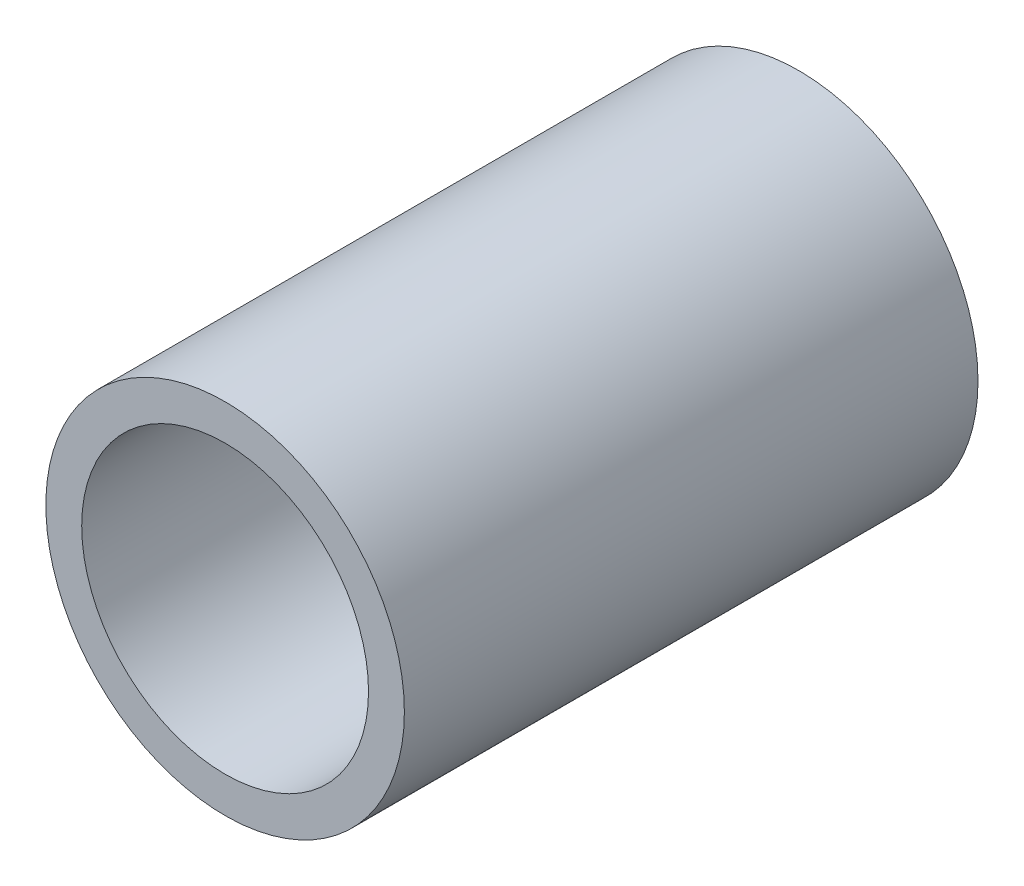
ISO-10303-21;
HEADER;
FILE_DESCRIPTION(('STEP AP214'),'2;1');
FILE_NAME('part.step','',(''),(''),'','','');
FILE_SCHEMA(('AUTOMOTIVE_DESIGN { 1 0 10303 214 1 1 1 1 }'));
ENDSEC;
DATA;
#1=APPLICATION_CONTEXT('core data for automotive mechanical design processes');
#2=APPLICATION_PROTOCOL_DEFINITION('international standard','automotive_design',2000,#1);
#3=PRODUCT_CONTEXT('',#1,'mechanical');
#4=PRODUCT('Part','Part','',(#3));
#5=PRODUCT_RELATED_PRODUCT_CATEGORY('part','',(#4));
#6=PRODUCT_DEFINITION_FORMATION('','',#4);
#7=PRODUCT_DEFINITION_CONTEXT('part definition',#1,'design');
#8=PRODUCT_DEFINITION('design','',#6,#7);
#9=PRODUCT_DEFINITION_SHAPE('','',#8);
#10=(LENGTH_UNIT() NAMED_UNIT(*) SI_UNIT(.MILLI.,.METRE.));
#11=(NAMED_UNIT(*) PLANE_ANGLE_UNIT() SI_UNIT($,.RADIAN.));
#12=(NAMED_UNIT(*) SI_UNIT($,.STERADIAN.) SOLID_ANGLE_UNIT());
#13=UNCERTAINTY_MEASURE_WITH_UNIT(LENGTH_MEASURE(1.E-05),#10,'distance_accuracy_value','');
#14=(GEOMETRIC_REPRESENTATION_CONTEXT(3) GLOBAL_UNCERTAINTY_ASSIGNED_CONTEXT((#13)) GLOBAL_UNIT_ASSIGNED_CONTEXT((#10,
#11,#12)) REPRESENTATION_CONTEXT('',''));
#15=CARTESIAN_POINT('',(0.,0.,0.));
#16=DIRECTION('',(0.,0.,1.));
#17=DIRECTION('',(1.,0.,0.));
#18=AXIS2_PLACEMENT_3D('',#15,#16,#17);
#19=CARTESIAN_POINT('',(0.,0.,12.));
#20=DIRECTION('',(0.,0.,1.));
#21=DIRECTION('',(1.,0.,0.));
#22=AXIS2_PLACEMENT_3D('',#19,#20,#21);
#23=PLANE('',#22);
#24=CARTESIAN_POINT('',(0.,0.,12.));
#25=DIRECTION('',(0.,0.,1.));
#26=DIRECTION('',(1.,0.,0.));
#27=AXIS2_PLACEMENT_3D('',#24,#25,#26);
#28=CIRCLE('',#27,7.5);
#29=CARTESIAN_POINT('',(7.5,0.,12.));
#30=VERTEX_POINT('',#29);
#31=EDGE_CURVE('E10',#30,#30,#28,.T.);
#32=ORIENTED_EDGE('',*,*,#31,.T.);
#33=EDGE_LOOP('',(#32));
#34=FACE_BOUND('',#33,.T.);
#35=CARTESIAN_POINT('',(0.,0.,12.));
#36=DIRECTION('',(0.,0.,1.));
#37=DIRECTION('',(1.,0.,0.));
#38=AXIS2_PLACEMENT_3D('',#35,#36,#37);
#39=CIRCLE('',#38,6.);
#40=CARTESIAN_POINT('',(6.,0.,12.));
#41=VERTEX_POINT('',#40);
#42=EDGE_CURVE('E42',#41,#41,#39,.T.);
#43=ORIENTED_EDGE('',*,*,#42,.F.);
#44=EDGE_LOOP('',(#43));
#45=FACE_BOUND('',#44,.T.);
#46=ADVANCED_FACE('F31',(#34,#45),#23,.T.);
#47=CARTESIAN_POINT('',(0.,0.,-12.));
#48=DIRECTION('',(0.,0.,1.));
#49=DIRECTION('',(1.,0.,0.));
#50=AXIS2_PLACEMENT_3D('',#47,#48,#49);
#51=PLANE('',#50);
#52=CARTESIAN_POINT('',(0.,0.,-12.));
#53=DIRECTION('',(0.,0.,1.));
#54=DIRECTION('',(1.,0.,0.));
#55=AXIS2_PLACEMENT_3D('',#52,#53,#54);
#56=CIRCLE('',#55,7.5);
#57=CARTESIAN_POINT('',(7.5,0.,-12.));
#58=VERTEX_POINT('',#57);
#59=EDGE_CURVE('E35',#58,#58,#56,.T.);
#60=ORIENTED_EDGE('',*,*,#59,.F.);
#61=EDGE_LOOP('',(#60));
#62=FACE_BOUND('',#61,.T.);
#63=CARTESIAN_POINT('',(0.,0.,-12.));
#64=DIRECTION('',(0.,0.,1.));
#65=DIRECTION('',(1.,0.,0.));
#66=AXIS2_PLACEMENT_3D('',#63,#64,#65);
#67=CIRCLE('',#66,6.);
#68=CARTESIAN_POINT('',(6.,0.,-12.));
#69=VERTEX_POINT('',#68);
#70=EDGE_CURVE('E44',#69,#69,#67,.T.);
#71=ORIENTED_EDGE('',*,*,#70,.T.);
#72=EDGE_LOOP('',(#71));
#73=FACE_BOUND('',#72,.T.);
#74=ADVANCED_FACE('F54',(#62,#73),#51,.F.);
#75=CARTESIAN_POINT('',(0.,0.,12.));
#76=DIRECTION('',(0.,0.,-1.));
#77=DIRECTION('',(-1.,0.,0.));
#78=AXIS2_PLACEMENT_3D('',#75,#76,#77);
#79=CYLINDRICAL_SURFACE('',#78,7.5);
#80=ORIENTED_EDGE('',*,*,#31,.F.);
#81=EDGE_LOOP('',(#80));
#82=FACE_BOUND('',#81,.T.);
#83=ORIENTED_EDGE('',*,*,#59,.T.);
#84=EDGE_LOOP('',(#83));
#85=FACE_BOUND('',#84,.T.);
#86=ADVANCED_FACE('F33',(#82,#85),#79,.T.);
#87=CARTESIAN_POINT('',(0.,0.,12.));
#88=DIRECTION('',(0.,0.,-1.));
#89=DIRECTION('',(-1.,0.,0.));
#90=AXIS2_PLACEMENT_3D('',#87,#88,#89);
#91=CYLINDRICAL_SURFACE('',#90,6.);
#92=ORIENTED_EDGE('',*,*,#42,.T.);
#93=EDGE_LOOP('',(#92));
#94=FACE_BOUND('',#93,.T.);
#95=ORIENTED_EDGE('',*,*,#70,.F.);
#96=EDGE_LOOP('',(#95));
#97=FACE_BOUND('',#96,.T.);
#98=ADVANCED_FACE('F50',(#94,#97),#91,.F.);
#99=CLOSED_SHELL('',(#46,#74,#86,#98));
#100=MANIFOLD_SOLID_BREP('B2',#99);
#101=ADVANCED_BREP_SHAPE_REPRESENTATION('',(#18,#100),#14);
#102=SHAPE_DEFINITION_REPRESENTATION(#9,#101);
ENDSEC;
END-ISO-10303-21;
